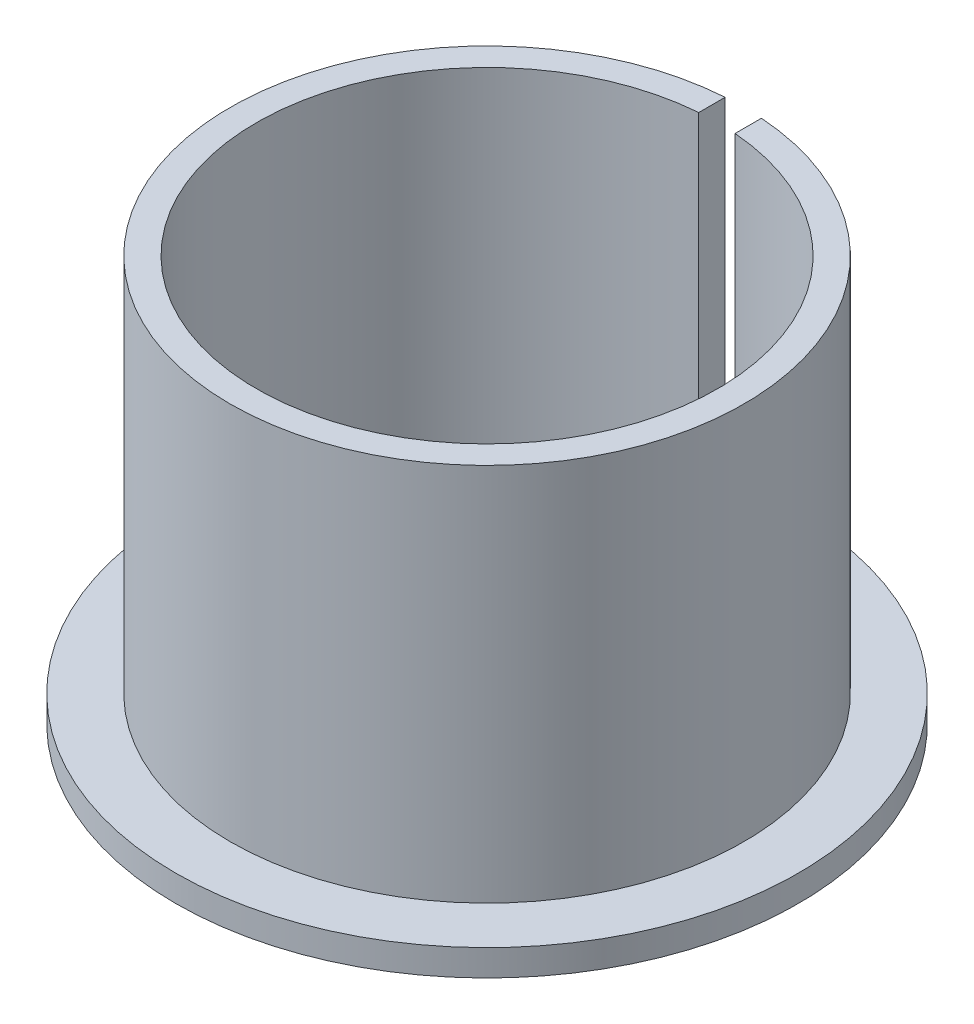
ISO-10303-21;
HEADER;
FILE_DESCRIPTION(('STEP AP214'),'2;1');
FILE_NAME('part.step','',(''),(''),'','','');
FILE_SCHEMA(('AUTOMOTIVE_DESIGN { 1 0 10303 214 1 1 1 1 }'));
ENDSEC;
DATA;
#1=APPLICATION_CONTEXT('core data for automotive mechanical design processes');
#2=APPLICATION_PROTOCOL_DEFINITION('international standard','automotive_design',2000,#1);
#3=PRODUCT_CONTEXT('',#1,'mechanical');
#4=PRODUCT('Part','Part','',(#3));
#5=PRODUCT_RELATED_PRODUCT_CATEGORY('part','',(#4));
#6=PRODUCT_DEFINITION_FORMATION('','',#4);
#7=PRODUCT_DEFINITION_CONTEXT('part definition',#1,'design');
#8=PRODUCT_DEFINITION('design','',#6,#7);
#9=PRODUCT_DEFINITION_SHAPE('','',#8);
#10=(LENGTH_UNIT() NAMED_UNIT(*) SI_UNIT(.MILLI.,.METRE.));
#11=(NAMED_UNIT(*) PLANE_ANGLE_UNIT() SI_UNIT($,.RADIAN.));
#12=(NAMED_UNIT(*) SI_UNIT($,.STERADIAN.) SOLID_ANGLE_UNIT());
#13=UNCERTAINTY_MEASURE_WITH_UNIT(LENGTH_MEASURE(1.E-05),#10,'distance_accuracy_value','');
#14=(GEOMETRIC_REPRESENTATION_CONTEXT(3) GLOBAL_UNCERTAINTY_ASSIGNED_CONTEXT((#13)) GLOBAL_UNIT_ASSIGNED_CONTEXT((#10,
#11,#12)) REPRESENTATION_CONTEXT('',''));
#15=CARTESIAN_POINT('',(0.,0.,0.));
#16=DIRECTION('',(0.,0.,1.));
#17=DIRECTION('',(1.,0.,0.));
#18=AXIS2_PLACEMENT_3D('',#15,#16,#17);
#19=CARTESIAN_POINT('',(17.15,2.78941873797242,0.));
#20=DIRECTION('',(0.,-1.,0.));
#21=DIRECTION('',(0.,0.,-1.));
#22=AXIS2_PLACEMENT_3D('',#19,#20,#21);
#23=PLANE('',#22);
#24=CARTESIAN_POINT('',(0.,2.78941873797242,0.));
#25=DIRECTION('',(0.,-1.,0.));
#26=DIRECTION('',(0.,0.,-1.));
#27=AXIS2_PLACEMENT_3D('',#24,#25,#26);
#28=CIRCLE('',#27,12.7);
#29=CARTESIAN_POINT('',(0.999999999999994,2.78941873797242,-12.6605687076055));
#30=VERTEX_POINT('',#29);
#31=CARTESIAN_POINT('',(-0.999999999999994,2.78941873797242,-12.6605687076055));
#32=VERTEX_POINT('',#31);
#33=EDGE_CURVE('E96',#30,#32,#28,.T.);
#34=ORIENTED_EDGE('',*,*,#33,.F.);
#35=DIRECTION('',(0.,0.,1.));
#36=VECTOR('',#35,1.);
#37=CARTESIAN_POINT('',(1.,2.78941873797242,-60.0408439065226));
#38=LINE('',#37,#36);
#39=CARTESIAN_POINT('',(0.999999999999995,2.78941873797242,-17.1208206579007));
#40=VERTEX_POINT('',#39);
#41=EDGE_CURVE('E85',#40,#30,#38,.T.);
#42=ORIENTED_EDGE('',*,*,#41,.F.);
#43=CARTESIAN_POINT('',(0.,2.78941873797242,0.));
#44=DIRECTION('',(0.,-1.,0.));
#45=DIRECTION('',(0.,0.,-1.));
#46=AXIS2_PLACEMENT_3D('',#43,#44,#45);
#47=CIRCLE('',#46,17.15);
#48=CARTESIAN_POINT('',(-0.999999999999995,2.78941873797242,-17.1208206579007));
#49=VERTEX_POINT('',#48);
#50=EDGE_CURVE('E94',#40,#49,#47,.T.);
#51=ORIENTED_EDGE('',*,*,#50,.T.);
#52=DIRECTION('',(0.,0.,1.));
#53=VECTOR('',#52,1.);
#54=CARTESIAN_POINT('',(-1.,2.78941873797242,-60.0408439065226));
#55=LINE('',#54,#53);
#56=EDGE_CURVE('E49',#49,#32,#55,.T.);
#57=ORIENTED_EDGE('',*,*,#56,.T.);
#58=EDGE_LOOP('',(#34,#42,#51,#57));
#59=FACE_BOUND('',#58,.T.);
#60=ADVANCED_FACE('F35',(#59),#23,.T.);
#61=CARTESIAN_POINT('',(0.,0.,0.));
#62=DIRECTION('',(0.,-1.,0.));
#63=DIRECTION('',(0.,0.,-1.));
#64=AXIS2_PLACEMENT_3D('',#61,#62,#63);
#65=CYLINDRICAL_SURFACE('',#64,12.7);
#66=CARTESIAN_POINT('',(0.,25.1194187379724,0.));
#67=DIRECTION('',(0.,-1.,0.));
#68=DIRECTION('',(0.,0.,-1.));
#69=AXIS2_PLACEMENT_3D('',#66,#67,#68);
#70=CIRCLE('',#69,12.7);
#71=CARTESIAN_POINT('',(0.999999999999994,25.1194187379724,-12.6605687076055));
#72=VERTEX_POINT('',#71);
#73=CARTESIAN_POINT('',(-0.999999999999994,25.1194187379724,-12.6605687076055));
#74=VERTEX_POINT('',#73);
#75=EDGE_CURVE('E114',#72,#74,#70,.T.);
#76=ORIENTED_EDGE('',*,*,#75,.F.);
#77=DIRECTION('',(0.,-1.,0.));
#78=VECTOR('',#77,1.);
#79=CARTESIAN_POINT('',(0.999999999999994,0.,-12.6605687076055));
#80=LINE('',#79,#78);
#81=EDGE_CURVE('E101',#72,#30,#80,.T.);
#82=ORIENTED_EDGE('',*,*,#81,.T.);
#83=ORIENTED_EDGE('',*,*,#33,.T.);
#84=DIRECTION('',(0.,-1.,0.));
#85=VECTOR('',#84,1.);
#86=CARTESIAN_POINT('',(-0.999999999999994,0.,-12.6605687076055));
#87=LINE('',#86,#85);
#88=EDGE_CURVE('E126',#74,#32,#87,.T.);
#89=ORIENTED_EDGE('',*,*,#88,.F.);
#90=EDGE_LOOP('',(#76,#82,#83,#89));
#91=FACE_BOUND('',#90,.T.);
#92=ADVANCED_FACE('F145',(#91),#65,.F.);
#93=CARTESIAN_POINT('',(12.7,25.1194187379724,0.));
#94=DIRECTION('',(0.,1.,0.));
#95=DIRECTION('',(0.,0.,1.));
#96=AXIS2_PLACEMENT_3D('',#93,#94,#95);
#97=PLANE('',#96);
#98=CARTESIAN_POINT('',(0.,25.1194187379724,0.));
#99=DIRECTION('',(0.,-1.,0.));
#100=DIRECTION('',(0.,0.,-1.));
#101=AXIS2_PLACEMENT_3D('',#98,#99,#100);
#102=CIRCLE('',#101,14.15);
#103=CARTESIAN_POINT('',(0.999999999999994,25.1194187379724,-14.114620079903));
#104=VERTEX_POINT('',#103);
#105=CARTESIAN_POINT('',(-0.999999999999994,25.1194187379724,-14.114620079903));
#106=VERTEX_POINT('',#105);
#107=EDGE_CURVE('E111',#104,#106,#102,.T.);
#108=ORIENTED_EDGE('',*,*,#107,.F.);
#109=DIRECTION('',(0.,0.,1.));
#110=VECTOR('',#109,1.);
#111=CARTESIAN_POINT('',(1.,25.1194187379724,-60.0408439065226));
#112=LINE('',#111,#110);
#113=EDGE_CURVE('E141',#104,#72,#112,.T.);
#114=ORIENTED_EDGE('',*,*,#113,.T.);
#115=ORIENTED_EDGE('',*,*,#75,.T.);
#116=DIRECTION('',(0.,0.,1.));
#117=VECTOR('',#116,1.);
#118=CARTESIAN_POINT('',(-1.,25.1194187379724,-60.0408439065226));
#119=LINE('',#118,#117);
#120=EDGE_CURVE('E97',#106,#74,#119,.T.);
#121=ORIENTED_EDGE('',*,*,#120,.F.);
#122=EDGE_LOOP('',(#108,#114,#115,#121));
#123=FACE_BOUND('',#122,.T.);
#124=ADVANCED_FACE('F140',(#123),#97,.T.);
#125=CARTESIAN_POINT('',(0.,0.,0.));
#126=DIRECTION('',(0.,-1.,0.));
#127=DIRECTION('',(0.,0.,-1.));
#128=AXIS2_PLACEMENT_3D('',#125,#126,#127);
#129=CYLINDRICAL_SURFACE('',#128,14.15);
#130=CARTESIAN_POINT('',(0.,4.23941873797242,0.));
#131=DIRECTION('',(0.,-1.,0.));
#132=DIRECTION('',(0.,0.,-1.));
#133=AXIS2_PLACEMENT_3D('',#130,#131,#132);
#134=CIRCLE('',#133,14.15);
#135=CARTESIAN_POINT('',(0.999999999999996,4.23941873797242,-14.114620079903));
#136=VERTEX_POINT('',#135);
#137=CARTESIAN_POINT('',(-0.999999999999996,4.23941873797242,-14.114620079903));
#138=VERTEX_POINT('',#137);
#139=EDGE_CURVE('E103',#136,#138,#134,.T.);
#140=ORIENTED_EDGE('',*,*,#139,.F.);
#141=DIRECTION('',(0.,-1.,0.));
#142=VECTOR('',#141,1.);
#143=CARTESIAN_POINT('',(0.999999999999994,0.,-14.114620079903));
#144=LINE('',#143,#142);
#145=EDGE_CURVE('E105',#136,#104,#144,.F.);
#146=ORIENTED_EDGE('',*,*,#145,.T.);
#147=ORIENTED_EDGE('',*,*,#107,.T.);
#148=DIRECTION('',(0.,-1.,0.));
#149=VECTOR('',#148,1.);
#150=CARTESIAN_POINT('',(-0.999999999999994,0.,-14.114620079903));
#151=LINE('',#150,#149);
#152=EDGE_CURVE('E124',#138,#106,#151,.F.);
#153=ORIENTED_EDGE('',*,*,#152,.F.);
#154=EDGE_LOOP('',(#140,#146,#147,#153));
#155=FACE_BOUND('',#154,.T.);
#156=ADVANCED_FACE('F136',(#155),#129,.T.);
#157=CARTESIAN_POINT('',(14.15,4.23941873797242,0.));
#158=DIRECTION('',(0.,1.,0.));
#159=DIRECTION('',(0.,0.,1.));
#160=AXIS2_PLACEMENT_3D('',#157,#158,#159);
#161=PLANE('',#160);
#162=CARTESIAN_POINT('',(0.,4.23941873797242,0.));
#163=DIRECTION('',(0.,-1.,0.));
#164=DIRECTION('',(0.,0.,-1.));
#165=AXIS2_PLACEMENT_3D('',#162,#163,#164);
#166=CIRCLE('',#165,17.15);
#167=CARTESIAN_POINT('',(0.999999999999995,4.23941873797242,-17.1208206579007));
#168=VERTEX_POINT('',#167);
#169=CARTESIAN_POINT('',(-0.999999999999995,4.23941873797242,-17.1208206579007));
#170=VERTEX_POINT('',#169);
#171=EDGE_CURVE('E100',#168,#170,#166,.T.);
#172=ORIENTED_EDGE('',*,*,#171,.F.);
#173=DIRECTION('',(0.,0.,1.));
#174=VECTOR('',#173,1.);
#175=CARTESIAN_POINT('',(0.999999999999994,4.23941873797242,0.));
#176=LINE('',#175,#174);
#177=EDGE_CURVE('E57',#168,#136,#176,.T.);
#178=ORIENTED_EDGE('',*,*,#177,.T.);
#179=ORIENTED_EDGE('',*,*,#139,.T.);
#180=DIRECTION('',(0.,0.,1.));
#181=VECTOR('',#180,1.);
#182=CARTESIAN_POINT('',(-0.999999999999994,4.23941873797242,0.));
#183=LINE('',#182,#181);
#184=EDGE_CURVE('E119',#170,#138,#183,.T.);
#185=ORIENTED_EDGE('',*,*,#184,.F.);
#186=EDGE_LOOP('',(#172,#178,#179,#185));
#187=FACE_BOUND('',#186,.T.);
#188=ADVANCED_FACE('F122',(#187),#161,.T.);
#189=CARTESIAN_POINT('',(0.,0.,0.));
#190=DIRECTION('',(0.,-1.,0.));
#191=DIRECTION('',(0.,0.,-1.));
#192=AXIS2_PLACEMENT_3D('',#189,#190,#191);
#193=CYLINDRICAL_SURFACE('',#192,17.15);
#194=ORIENTED_EDGE('',*,*,#50,.F.);
#195=DIRECTION('',(0.,-1.,0.));
#196=VECTOR('',#195,1.);
#197=CARTESIAN_POINT('',(0.999999999999995,0.,-17.1208206579007));
#198=LINE('',#197,#196);
#199=EDGE_CURVE('E11',#40,#168,#198,.F.);
#200=ORIENTED_EDGE('',*,*,#199,.T.);
#201=ORIENTED_EDGE('',*,*,#171,.T.);
#202=DIRECTION('',(0.,-1.,0.));
#203=VECTOR('',#202,1.);
#204=CARTESIAN_POINT('',(-0.999999999999995,0.,-17.1208206579007));
#205=LINE('',#204,#203);
#206=EDGE_CURVE('E42',#49,#170,#205,.F.);
#207=ORIENTED_EDGE('',*,*,#206,.F.);
#208=EDGE_LOOP('',(#194,#200,#201,#207));
#209=FACE_BOUND('',#208,.T.);
#210=ADVANCED_FACE('F99',(#209),#193,.T.);
#211=CARTESIAN_POINT('',(-1.,2.78941873797242,-60.0408439065226));
#212=DIRECTION('',(-1.,0.,0.));
#213=DIRECTION('',(0.,0.,1.));
#214=AXIS2_PLACEMENT_3D('',#211,#212,#213);
#215=PLANE('',#214);
#216=ORIENTED_EDGE('',*,*,#88,.T.);
#217=ORIENTED_EDGE('',*,*,#56,.F.);
#218=ORIENTED_EDGE('',*,*,#206,.T.);
#219=ORIENTED_EDGE('',*,*,#184,.T.);
#220=ORIENTED_EDGE('',*,*,#152,.T.);
#221=ORIENTED_EDGE('',*,*,#120,.T.);
#222=EDGE_LOOP('',(#216,#217,#218,#219,#220,#221));
#223=FACE_BOUND('',#222,.T.);
#224=ADVANCED_FACE('F118',(#223),#215,.F.);
#225=CARTESIAN_POINT('',(1.,2.78941873797242,-60.0408439065226));
#226=DIRECTION('',(-1.,0.,0.));
#227=DIRECTION('',(0.,0.,1.));
#228=AXIS2_PLACEMENT_3D('',#225,#226,#227);
#229=PLANE('',#228);
#230=ORIENTED_EDGE('',*,*,#113,.F.);
#231=ORIENTED_EDGE('',*,*,#145,.F.);
#232=ORIENTED_EDGE('',*,*,#177,.F.);
#233=ORIENTED_EDGE('',*,*,#199,.F.);
#234=ORIENTED_EDGE('',*,*,#41,.T.);
#235=ORIENTED_EDGE('',*,*,#81,.F.);
#236=EDGE_LOOP('',(#230,#231,#232,#233,#234,#235));
#237=FACE_BOUND('',#236,.T.);
#238=ADVANCED_FACE('F84',(#237),#229,.T.);
#239=CLOSED_SHELL('',(#60,#92,#124,#156,#188,#210,#224,#238));
#240=MANIFOLD_SOLID_BREP('B2',#239);
#241=ADVANCED_BREP_SHAPE_REPRESENTATION('',(#18,#240),#14);
#242=SHAPE_DEFINITION_REPRESENTATION(#9,#241);
ENDSEC;
END-ISO-10303-21;
